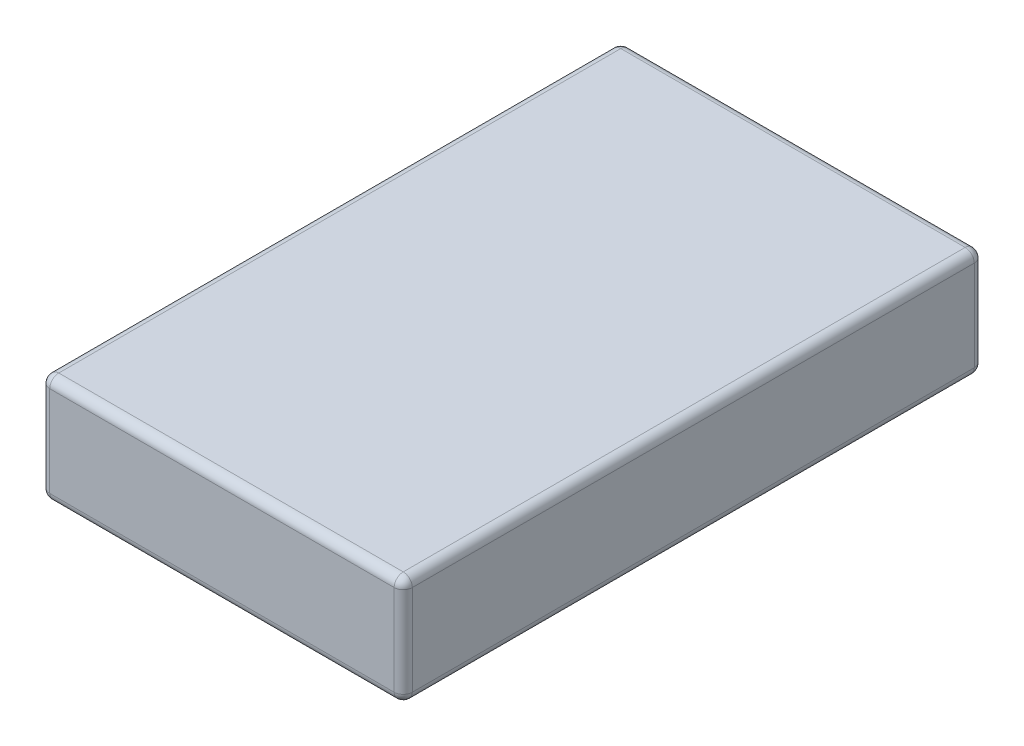
ISO-10303-21;
HEADER;
FILE_DESCRIPTION(('STEP AP214'),'2;1');
FILE_NAME('part.step','',(''),(''),'','','');
FILE_SCHEMA(('AUTOMOTIVE_DESIGN { 1 0 10303 214 1 1 1 1 }'));
ENDSEC;
DATA;
#1=APPLICATION_CONTEXT('core data for automotive mechanical design processes');
#2=APPLICATION_PROTOCOL_DEFINITION('international standard','automotive_design',2000,#1);
#3=PRODUCT_CONTEXT('',#1,'mechanical');
#4=PRODUCT('Part','Part','',(#3));
#5=PRODUCT_RELATED_PRODUCT_CATEGORY('part','',(#4));
#6=PRODUCT_DEFINITION_FORMATION('','',#4);
#7=PRODUCT_DEFINITION_CONTEXT('part definition',#1,'design');
#8=PRODUCT_DEFINITION('design','',#6,#7);
#9=PRODUCT_DEFINITION_SHAPE('','',#8);
#10=(LENGTH_UNIT() NAMED_UNIT(*) SI_UNIT(.MILLI.,.METRE.));
#11=(NAMED_UNIT(*) PLANE_ANGLE_UNIT() SI_UNIT($,.RADIAN.));
#12=(NAMED_UNIT(*) SI_UNIT($,.STERADIAN.) SOLID_ANGLE_UNIT());
#13=UNCERTAINTY_MEASURE_WITH_UNIT(LENGTH_MEASURE(1.E-05),#10,'distance_accuracy_value','');
#14=(GEOMETRIC_REPRESENTATION_CONTEXT(3) GLOBAL_UNCERTAINTY_ASSIGNED_CONTEXT((#13)) GLOBAL_UNIT_ASSIGNED_CONTEXT((#10,
#11,#12)) REPRESENTATION_CONTEXT('',''));
#15=CARTESIAN_POINT('',(0.,0.,0.));
#16=DIRECTION('',(0.,0.,1.));
#17=DIRECTION('',(1.,0.,0.));
#18=AXIS2_PLACEMENT_3D('',#15,#16,#17);
#19=CARTESIAN_POINT('',(10.,6.,16.));
#20=DIRECTION('',(-1.,0.,0.));
#21=DIRECTION('',(0.,0.,1.));
#22=AXIS2_PLACEMENT_3D('',#19,#20,#21);
#23=PLANE('',#22);
#24=DIRECTION('',(0.,-1.,0.));
#25=VECTOR('',#24,1.);
#26=CARTESIAN_POINT('',(10.,6.,15.5));
#27=LINE('',#26,#25);
#28=CARTESIAN_POINT('',(10.,5.5,15.5));
#29=VERTEX_POINT('',#28);
#30=CARTESIAN_POINT('',(10.,0.5,15.5));
#31=VERTEX_POINT('',#30);
#32=EDGE_CURVE('E208',#29,#31,#27,.T.);
#33=ORIENTED_EDGE('',*,*,#32,.T.);
#34=DIRECTION('',(0.,0.,-1.));
#35=VECTOR('',#34,1.);
#36=CARTESIAN_POINT('',(10.,0.5,-16.));
#37=LINE('',#36,#35);
#38=CARTESIAN_POINT('',(10.,0.5,-15.5));
#39=VERTEX_POINT('',#38);
#40=EDGE_CURVE('E212',#31,#39,#37,.T.);
#41=ORIENTED_EDGE('',*,*,#40,.T.);
#42=DIRECTION('',(0.,-1.,0.));
#43=VECTOR('',#42,1.);
#44=CARTESIAN_POINT('',(10.,6.,-15.5));
#45=LINE('',#44,#43);
#46=CARTESIAN_POINT('',(10.,5.5,-15.5));
#47=VERTEX_POINT('',#46);
#48=EDGE_CURVE('E205',#39,#47,#45,.F.);
#49=ORIENTED_EDGE('',*,*,#48,.T.);
#50=DIRECTION('',(0.,0.,-1.));
#51=VECTOR('',#50,1.);
#52=CARTESIAN_POINT('',(10.,5.5,16.));
#53=LINE('',#52,#51);
#54=EDGE_CURVE('E202',#47,#29,#53,.F.);
#55=ORIENTED_EDGE('',*,*,#54,.T.);
#56=EDGE_LOOP('',(#33,#41,#49,#55));
#57=FACE_BOUND('',#56,.T.);
#58=ADVANCED_FACE('F39',(#57),#23,.F.);
#59=CARTESIAN_POINT('',(-10.,6.,-16.));
#60=DIRECTION('',(0.,0.,1.));
#61=DIRECTION('',(1.,0.,0.));
#62=AXIS2_PLACEMENT_3D('',#59,#60,#61);
#63=PLANE('',#62);
#64=DIRECTION('',(0.,-1.,0.));
#65=VECTOR('',#64,1.);
#66=CARTESIAN_POINT('',(9.5,6.,-16.));
#67=LINE('',#66,#65);
#68=CARTESIAN_POINT('',(9.5,5.5,-16.));
#69=VERTEX_POINT('',#68);
#70=CARTESIAN_POINT('',(9.5,0.5,-16.));
#71=VERTEX_POINT('',#70);
#72=EDGE_CURVE('E181',#69,#71,#67,.T.);
#73=ORIENTED_EDGE('',*,*,#72,.T.);
#74=DIRECTION('',(-1.,0.,0.));
#75=VECTOR('',#74,1.);
#76=CARTESIAN_POINT('',(-10.,0.5,-16.));
#77=LINE('',#76,#75);
#78=CARTESIAN_POINT('',(-9.5,0.5,-16.));
#79=VERTEX_POINT('',#78);
#80=EDGE_CURVE('E188',#71,#79,#77,.T.);
#81=ORIENTED_EDGE('',*,*,#80,.T.);
#82=DIRECTION('',(0.,-1.,0.));
#83=VECTOR('',#82,1.);
#84=CARTESIAN_POINT('',(-9.5,6.,-16.));
#85=LINE('',#84,#83);
#86=CARTESIAN_POINT('',(-9.5,5.5,-16.));
#87=VERTEX_POINT('',#86);
#88=EDGE_CURVE('E184',#79,#87,#85,.F.);
#89=ORIENTED_EDGE('',*,*,#88,.T.);
#90=DIRECTION('',(-1.,0.,0.));
#91=VECTOR('',#90,1.);
#92=CARTESIAN_POINT('',(-10.,5.5,-16.));
#93=LINE('',#92,#91);
#94=EDGE_CURVE('E178',#87,#69,#93,.F.);
#95=ORIENTED_EDGE('',*,*,#94,.T.);
#96=EDGE_LOOP('',(#73,#81,#89,#95));
#97=FACE_BOUND('',#96,.T.);
#98=ADVANCED_FACE('F359',(#97),#63,.F.);
#99=CARTESIAN_POINT('',(-10.,6.,16.));
#100=DIRECTION('',(1.,0.,0.));
#101=DIRECTION('',(0.,0.,-1.));
#102=AXIS2_PLACEMENT_3D('',#99,#100,#101);
#103=PLANE('',#102);
#104=DIRECTION('',(0.,-1.,0.));
#105=VECTOR('',#104,1.);
#106=CARTESIAN_POINT('',(-10.,6.,-15.5));
#107=LINE('',#106,#105);
#108=CARTESIAN_POINT('',(-10.,5.5,-15.5));
#109=VERTEX_POINT('',#108);
#110=CARTESIAN_POINT('',(-10.,0.5,-15.5));
#111=VERTEX_POINT('',#110);
#112=EDGE_CURVE('E140',#109,#111,#107,.T.);
#113=ORIENTED_EDGE('',*,*,#112,.T.);
#114=DIRECTION('',(0.,0.,1.));
#115=VECTOR('',#114,1.);
#116=CARTESIAN_POINT('',(-10.,0.5,16.));
#117=LINE('',#116,#115);
#118=CARTESIAN_POINT('',(-10.,0.5,15.5));
#119=VERTEX_POINT('',#118);
#120=EDGE_CURVE('E135',#111,#119,#117,.T.);
#121=ORIENTED_EDGE('',*,*,#120,.T.);
#122=DIRECTION('',(0.,-1.,0.));
#123=VECTOR('',#122,1.);
#124=CARTESIAN_POINT('',(-10.,6.,15.5));
#125=LINE('',#124,#123);
#126=CARTESIAN_POINT('',(-10.,5.5,15.5));
#127=VERTEX_POINT('',#126);
#128=EDGE_CURVE('E127',#119,#127,#125,.F.);
#129=ORIENTED_EDGE('',*,*,#128,.T.);
#130=DIRECTION('',(0.,0.,1.));
#131=VECTOR('',#130,1.);
#132=CARTESIAN_POINT('',(-10.,5.5,16.));
#133=LINE('',#132,#131);
#134=EDGE_CURVE('E132',#127,#109,#133,.F.);
#135=ORIENTED_EDGE('',*,*,#134,.T.);
#136=EDGE_LOOP('',(#113,#121,#129,#135));
#137=FACE_BOUND('',#136,.T.);
#138=ADVANCED_FACE('F130',(#137),#103,.F.);
#139=CARTESIAN_POINT('',(-10.,6.,16.));
#140=DIRECTION('',(0.,0.,-1.));
#141=DIRECTION('',(-1.,0.,0.));
#142=AXIS2_PLACEMENT_3D('',#139,#140,#141);
#143=PLANE('',#142);
#144=DIRECTION('',(0.,-1.,0.));
#145=VECTOR('',#144,1.);
#146=CARTESIAN_POINT('',(-9.5,6.,16.));
#147=LINE('',#146,#145);
#148=CARTESIAN_POINT('',(-9.5,5.5,16.));
#149=VERTEX_POINT('',#148);
#150=CARTESIAN_POINT('',(-9.5,0.5,16.));
#151=VERTEX_POINT('',#150);
#152=EDGE_CURVE('E148',#149,#151,#147,.T.);
#153=ORIENTED_EDGE('',*,*,#152,.T.);
#154=DIRECTION('',(1.,0.,0.));
#155=VECTOR('',#154,1.);
#156=CARTESIAN_POINT('',(10.,0.5,16.));
#157=LINE('',#156,#155);
#158=CARTESIAN_POINT('',(9.5,0.5,16.));
#159=VERTEX_POINT('',#158);
#160=EDGE_CURVE('E199',#151,#159,#157,.T.);
#161=ORIENTED_EDGE('',*,*,#160,.T.);
#162=DIRECTION('',(0.,-1.,0.));
#163=VECTOR('',#162,1.);
#164=CARTESIAN_POINT('',(9.5,6.,16.));
#165=LINE('',#164,#163);
#166=CARTESIAN_POINT('',(9.5,5.5,16.));
#167=VERTEX_POINT('',#166);
#168=EDGE_CURVE('E194',#159,#167,#165,.F.);
#169=ORIENTED_EDGE('',*,*,#168,.T.);
#170=DIRECTION('',(1.,0.,0.));
#171=VECTOR('',#170,1.);
#172=CARTESIAN_POINT('',(-10.,5.5,16.));
#173=LINE('',#172,#171);
#174=EDGE_CURVE('E191',#167,#149,#173,.F.);
#175=ORIENTED_EDGE('',*,*,#174,.T.);
#176=EDGE_LOOP('',(#153,#161,#169,#175));
#177=FACE_BOUND('',#176,.T.);
#178=ADVANCED_FACE('F350',(#177),#143,.F.);
#179=CARTESIAN_POINT('',(0.,6.,0.));
#180=DIRECTION('',(0.,-1.,0.));
#181=DIRECTION('',(0.,0.,-1.));
#182=AXIS2_PLACEMENT_3D('',#179,#180,#181);
#183=PLANE('',#182);
#184=DIRECTION('',(0.,0.,1.));
#185=VECTOR('',#184,1.);
#186=CARTESIAN_POINT('',(-9.5,6.,0.));
#187=LINE('',#186,#185);
#188=CARTESIAN_POINT('',(-9.5,6.,-15.5));
#189=VERTEX_POINT('',#188);
#190=CARTESIAN_POINT('',(-9.5,6.,15.5));
#191=VERTEX_POINT('',#190);
#192=EDGE_CURVE('E49',#189,#191,#187,.T.);
#193=ORIENTED_EDGE('',*,*,#192,.T.);
#194=DIRECTION('',(1.,0.,0.));
#195=VECTOR('',#194,1.);
#196=CARTESIAN_POINT('',(0.,6.,15.5));
#197=LINE('',#196,#195);
#198=CARTESIAN_POINT('',(9.5,6.,15.5));
#199=VERTEX_POINT('',#198);
#200=EDGE_CURVE('E11',#191,#199,#197,.T.);
#201=ORIENTED_EDGE('',*,*,#200,.T.);
#202=DIRECTION('',(0.,0.,-1.));
#203=VECTOR('',#202,1.);
#204=CARTESIAN_POINT('',(9.5,6.,0.));
#205=LINE('',#204,#203);
#206=CARTESIAN_POINT('',(9.5,6.,-15.5));
#207=VERTEX_POINT('',#206);
#208=EDGE_CURVE('E228',#199,#207,#205,.T.);
#209=ORIENTED_EDGE('',*,*,#208,.T.);
#210=DIRECTION('',(-1.,0.,0.));
#211=VECTOR('',#210,1.);
#212=CARTESIAN_POINT('',(0.,6.,-15.5));
#213=LINE('',#212,#211);
#214=EDGE_CURVE('E60',#207,#189,#213,.T.);
#215=ORIENTED_EDGE('',*,*,#214,.T.);
#216=EDGE_LOOP('',(#193,#201,#209,#215));
#217=FACE_BOUND('',#216,.T.);
#218=ADVANCED_FACE('F352',(#217),#183,.F.);
#219=CARTESIAN_POINT('',(0.,0.,0.));
#220=DIRECTION('',(0.,-1.,0.));
#221=DIRECTION('',(0.,0.,-1.));
#222=AXIS2_PLACEMENT_3D('',#219,#220,#221);
#223=PLANE('',#222);
#224=DIRECTION('',(0.,0.,1.));
#225=VECTOR('',#224,1.);
#226=CARTESIAN_POINT('',(-9.5,0.,-16.));
#227=LINE('',#226,#225);
#228=CARTESIAN_POINT('',(-9.5,0.,15.5));
#229=VERTEX_POINT('',#228);
#230=CARTESIAN_POINT('',(-9.5,0.,-15.5));
#231=VERTEX_POINT('',#230);
#232=EDGE_CURVE('E221',#229,#231,#227,.F.);
#233=ORIENTED_EDGE('',*,*,#232,.T.);
#234=DIRECTION('',(-1.,0.,0.));
#235=VECTOR('',#234,1.);
#236=CARTESIAN_POINT('',(10.,0.,-15.5));
#237=LINE('',#236,#235);
#238=CARTESIAN_POINT('',(9.5,0.,-15.5));
#239=VERTEX_POINT('',#238);
#240=EDGE_CURVE('E224',#231,#239,#237,.F.);
#241=ORIENTED_EDGE('',*,*,#240,.T.);
#242=DIRECTION('',(0.,0.,-1.));
#243=VECTOR('',#242,1.);
#244=CARTESIAN_POINT('',(9.5,0.,16.));
#245=LINE('',#244,#243);
#246=CARTESIAN_POINT('',(9.5,0.,15.5));
#247=VERTEX_POINT('',#246);
#248=EDGE_CURVE('E215',#239,#247,#245,.F.);
#249=ORIENTED_EDGE('',*,*,#248,.T.);
#250=DIRECTION('',(1.,0.,0.));
#251=VECTOR('',#250,1.);
#252=CARTESIAN_POINT('',(-10.,0.,15.5));
#253=LINE('',#252,#251);
#254=EDGE_CURVE('E218',#247,#229,#253,.F.);
#255=ORIENTED_EDGE('',*,*,#254,.T.);
#256=EDGE_LOOP('',(#233,#241,#249,#255));
#257=FACE_BOUND('',#256,.T.);
#258=ADVANCED_FACE('F319',(#257),#223,.T.);
#259=CARTESIAN_POINT('',(9.5,6.,15.5));
#260=DIRECTION('',(0.,-1.,0.));
#261=DIRECTION('',(0.,0.,-1.));
#262=AXIS2_PLACEMENT_3D('',#259,#260,#261);
#263=CYLINDRICAL_SURFACE('',#262,0.5);
#264=CARTESIAN_POINT('',(9.5,5.5,15.5));
#265=DIRECTION('',(0.,1.,0.));
#266=DIRECTION('',(0.,0.,1.));
#267=AXIS2_PLACEMENT_3D('',#264,#265,#266);
#268=CIRCLE('',#267,0.5);
#269=EDGE_CURVE('E43',#167,#29,#268,.T.);
#270=ORIENTED_EDGE('',*,*,#269,.F.);
#271=ORIENTED_EDGE('',*,*,#168,.F.);
#272=CARTESIAN_POINT('',(9.5,0.5,15.5));
#273=DIRECTION('',(0.,-1.,0.));
#274=DIRECTION('',(0.,0.,-1.));
#275=AXIS2_PLACEMENT_3D('',#272,#273,#274);
#276=CIRCLE('',#275,0.5);
#277=EDGE_CURVE('E172',#31,#159,#276,.T.);
#278=ORIENTED_EDGE('',*,*,#277,.F.);
#279=ORIENTED_EDGE('',*,*,#32,.F.);
#280=EDGE_LOOP('',(#270,#271,#278,#279));
#281=FACE_BOUND('',#280,.T.);
#282=ADVANCED_FACE('F41',(#281),#263,.T.);
#283=CARTESIAN_POINT('',(9.5,5.5,15.5));
#284=DIRECTION('',(1.,0.,0.));
#285=DIRECTION('',(0.,0.,-1.));
#286=AXIS2_PLACEMENT_3D('',#283,#284,#285);
#287=SPHERICAL_SURFACE('',#286,0.5);
#288=CARTESIAN_POINT('',(9.5,5.5,15.5));
#289=DIRECTION('',(1.,0.,0.));
#290=DIRECTION('',(0.,0.,-1.));
#291=AXIS2_PLACEMENT_3D('',#288,#289,#290);
#292=CIRCLE('',#291,0.5);
#293=EDGE_CURVE('E295',#167,#199,#292,.F.);
#294=ORIENTED_EDGE('',*,*,#293,.F.);
#295=ORIENTED_EDGE('',*,*,#269,.T.);
#296=CARTESIAN_POINT('',(9.5,5.5,15.5));
#297=DIRECTION('',(0.,0.,1.));
#298=DIRECTION('',(1.,0.,0.));
#299=AXIS2_PLACEMENT_3D('',#296,#297,#298);
#300=CIRCLE('',#299,0.5);
#301=EDGE_CURVE('E299',#199,#29,#300,.F.);
#302=ORIENTED_EDGE('',*,*,#301,.F.);
#303=EDGE_LOOP('',(#294,#295,#302));
#304=FACE_BOUND('',#303,.T.);
#305=ADVANCED_FACE('F345',(#304),#287,.T.);
#306=CARTESIAN_POINT('',(9.5,0.5,15.5));
#307=DIRECTION('',(0.,0.,1.));
#308=DIRECTION('',(0.,-1.,0.));
#309=AXIS2_PLACEMENT_3D('',#306,#307,#308);
#310=SPHERICAL_SURFACE('',#309,0.5);
#311=CARTESIAN_POINT('',(9.5,0.5,15.5));
#312=DIRECTION('',(0.,0.,1.));
#313=DIRECTION('',(1.,0.,0.));
#314=AXIS2_PLACEMENT_3D('',#311,#312,#313);
#315=CIRCLE('',#314,0.5);
#316=EDGE_CURVE('E287',#31,#247,#315,.F.);
#317=ORIENTED_EDGE('',*,*,#316,.F.);
#318=ORIENTED_EDGE('',*,*,#277,.T.);
#319=CARTESIAN_POINT('',(9.5,0.5,15.5));
#320=DIRECTION('',(1.,0.,0.));
#321=DIRECTION('',(0.,0.,-1.));
#322=AXIS2_PLACEMENT_3D('',#319,#320,#321);
#323=CIRCLE('',#322,0.5);
#324=EDGE_CURVE('E291',#247,#159,#323,.F.);
#325=ORIENTED_EDGE('',*,*,#324,.F.);
#326=EDGE_LOOP('',(#317,#318,#325));
#327=FACE_BOUND('',#326,.T.);
#328=ADVANCED_FACE('F308',(#327),#310,.T.);
#329=CARTESIAN_POINT('',(9.5,5.5,0.));
#330=DIRECTION('',(0.,0.,-1.));
#331=DIRECTION('',(-1.,0.,0.));
#332=AXIS2_PLACEMENT_3D('',#329,#330,#331);
#333=CYLINDRICAL_SURFACE('',#332,0.5);
#334=ORIENTED_EDGE('',*,*,#301,.T.);
#335=ORIENTED_EDGE('',*,*,#54,.F.);
#336=CARTESIAN_POINT('',(9.5,5.5,-15.5));
#337=DIRECTION('',(0.,0.,-1.));
#338=DIRECTION('',(-1.,0.,0.));
#339=AXIS2_PLACEMENT_3D('',#336,#337,#338);
#340=CIRCLE('',#339,0.5);
#341=EDGE_CURVE('E279',#207,#47,#340,.T.);
#342=ORIENTED_EDGE('',*,*,#341,.F.);
#343=ORIENTED_EDGE('',*,*,#208,.F.);
#344=EDGE_LOOP('',(#334,#335,#342,#343));
#345=FACE_BOUND('',#344,.T.);
#346=ADVANCED_FACE('F340',(#345),#333,.T.);
#347=CARTESIAN_POINT('',(0.,5.5,15.5));
#348=DIRECTION('',(1.,0.,0.));
#349=DIRECTION('',(0.,0.,-1.));
#350=AXIS2_PLACEMENT_3D('',#347,#348,#349);
#351=CYLINDRICAL_SURFACE('',#350,0.5);
#352=ORIENTED_EDGE('',*,*,#293,.T.);
#353=ORIENTED_EDGE('',*,*,#200,.F.);
#354=CARTESIAN_POINT('',(-9.5,5.5,15.5));
#355=DIRECTION('',(-1.,0.,0.));
#356=DIRECTION('',(0.,0.,1.));
#357=AXIS2_PLACEMENT_3D('',#354,#355,#356);
#358=CIRCLE('',#357,0.5);
#359=EDGE_CURVE('E153',#149,#191,#358,.T.);
#360=ORIENTED_EDGE('',*,*,#359,.F.);
#361=ORIENTED_EDGE('',*,*,#174,.F.);
#362=EDGE_LOOP('',(#352,#353,#360,#361));
#363=FACE_BOUND('',#362,.T.);
#364=ADVANCED_FACE('F348',(#363),#351,.T.);
#365=CARTESIAN_POINT('',(-9.5,6.,15.5));
#366=DIRECTION('',(0.,-1.,0.));
#367=DIRECTION('',(0.,0.,-1.));
#368=AXIS2_PLACEMENT_3D('',#365,#366,#367);
#369=CYLINDRICAL_SURFACE('',#368,0.5);
#370=CARTESIAN_POINT('',(-9.5,0.5,15.5));
#371=DIRECTION('',(0.,-1.,0.));
#372=DIRECTION('',(0.,0.,-1.));
#373=AXIS2_PLACEMENT_3D('',#370,#371,#372);
#374=CIRCLE('',#373,0.5);
#375=EDGE_CURVE('E154',#151,#119,#374,.T.);
#376=ORIENTED_EDGE('',*,*,#375,.F.);
#377=ORIENTED_EDGE('',*,*,#152,.F.);
#378=CARTESIAN_POINT('',(-9.5,5.5,15.5));
#379=DIRECTION('',(0.,1.,0.));
#380=DIRECTION('',(0.,0.,1.));
#381=AXIS2_PLACEMENT_3D('',#378,#379,#380);
#382=CIRCLE('',#381,0.5);
#383=EDGE_CURVE('E144',#127,#149,#382,.T.);
#384=ORIENTED_EDGE('',*,*,#383,.F.);
#385=ORIENTED_EDGE('',*,*,#128,.F.);
#386=EDGE_LOOP('',(#376,#377,#384,#385));
#387=FACE_BOUND('',#386,.T.);
#388=ADVANCED_FACE('F146',(#387),#369,.T.);
#389=CARTESIAN_POINT('',(-10.,0.5,15.5));
#390=DIRECTION('',(-1.,0.,0.));
#391=DIRECTION('',(0.,0.,1.));
#392=AXIS2_PLACEMENT_3D('',#389,#390,#391);
#393=CYLINDRICAL_SURFACE('',#392,0.5);
#394=ORIENTED_EDGE('',*,*,#324,.T.);
#395=ORIENTED_EDGE('',*,*,#160,.F.);
#396=CARTESIAN_POINT('',(-9.5,0.5,15.5));
#397=DIRECTION('',(-1.,0.,0.));
#398=DIRECTION('',(0.,0.,1.));
#399=AXIS2_PLACEMENT_3D('',#396,#397,#398);
#400=CIRCLE('',#399,0.5);
#401=EDGE_CURVE('E272',#229,#151,#400,.T.);
#402=ORIENTED_EDGE('',*,*,#401,.F.);
#403=ORIENTED_EDGE('',*,*,#254,.F.);
#404=EDGE_LOOP('',(#394,#395,#402,#403));
#405=FACE_BOUND('',#404,.T.);
#406=ADVANCED_FACE('F315',(#405),#393,.T.);
#407=CARTESIAN_POINT('',(9.5,0.5,16.));
#408=DIRECTION('',(0.,0.,1.));
#409=DIRECTION('',(1.,0.,0.));
#410=AXIS2_PLACEMENT_3D('',#407,#408,#409);
#411=CYLINDRICAL_SURFACE('',#410,0.5);
#412=ORIENTED_EDGE('',*,*,#316,.T.);
#413=ORIENTED_EDGE('',*,*,#248,.F.);
#414=CARTESIAN_POINT('',(9.5,0.5,-15.5));
#415=DIRECTION('',(0.,0.,-1.));
#416=DIRECTION('',(-1.,0.,0.));
#417=AXIS2_PLACEMENT_3D('',#414,#415,#416);
#418=CIRCLE('',#417,0.5);
#419=EDGE_CURVE('E268',#39,#239,#418,.T.);
#420=ORIENTED_EDGE('',*,*,#419,.F.);
#421=ORIENTED_EDGE('',*,*,#40,.F.);
#422=EDGE_LOOP('',(#412,#413,#420,#421));
#423=FACE_BOUND('',#422,.T.);
#424=ADVANCED_FACE('F325',(#423),#411,.T.);
#425=CARTESIAN_POINT('',(9.5,6.,-15.5));
#426=DIRECTION('',(0.,-1.,0.));
#427=DIRECTION('',(0.,0.,-1.));
#428=AXIS2_PLACEMENT_3D('',#425,#426,#427);
#429=CYLINDRICAL_SURFACE('',#428,0.5);
#430=CARTESIAN_POINT('',(9.5,5.5,-15.5));
#431=DIRECTION('',(0.,1.,0.));
#432=DIRECTION('',(0.,0.,1.));
#433=AXIS2_PLACEMENT_3D('',#430,#431,#432);
#434=CIRCLE('',#433,0.5);
#435=EDGE_CURVE('E283',#47,#69,#434,.T.);
#436=ORIENTED_EDGE('',*,*,#435,.F.);
#437=ORIENTED_EDGE('',*,*,#48,.F.);
#438=CARTESIAN_POINT('',(9.5,0.5,-15.5));
#439=DIRECTION('',(0.,-1.,0.));
#440=DIRECTION('',(0.,0.,-1.));
#441=AXIS2_PLACEMENT_3D('',#438,#439,#440);
#442=CIRCLE('',#441,0.5);
#443=EDGE_CURVE('E264',#71,#39,#442,.T.);
#444=ORIENTED_EDGE('',*,*,#443,.F.);
#445=ORIENTED_EDGE('',*,*,#72,.F.);
#446=EDGE_LOOP('',(#436,#437,#444,#445));
#447=FACE_BOUND('',#446,.T.);
#448=ADVANCED_FACE('F332',(#447),#429,.T.);
#449=CARTESIAN_POINT('',(9.5,5.5,-15.5));
#450=DIRECTION('',(1.,0.,0.));
#451=DIRECTION('',(0.,0.,-1.));
#452=AXIS2_PLACEMENT_3D('',#449,#450,#451);
#453=SPHERICAL_SURFACE('',#452,0.5);
#454=ORIENTED_EDGE('',*,*,#341,.T.);
#455=ORIENTED_EDGE('',*,*,#435,.T.);
#456=CARTESIAN_POINT('',(9.5,5.5,-15.5));
#457=DIRECTION('',(1.,0.,0.));
#458=DIRECTION('',(0.,0.,-1.));
#459=AXIS2_PLACEMENT_3D('',#456,#457,#458);
#460=CIRCLE('',#459,0.5);
#461=EDGE_CURVE('E161',#207,#69,#460,.F.);
#462=ORIENTED_EDGE('',*,*,#461,.F.);
#463=EDGE_LOOP('',(#454,#455,#462));
#464=FACE_BOUND('',#463,.T.);
#465=ADVANCED_FACE('F338',(#464),#453,.T.);
#466=CARTESIAN_POINT('',(-9.5,5.5,15.5));
#467=DIRECTION('',(0.,0.,1.));
#468=DIRECTION('',(1.,0.,0.));
#469=AXIS2_PLACEMENT_3D('',#466,#467,#468);
#470=SPHERICAL_SURFACE('',#469,0.5);
#471=ORIENTED_EDGE('',*,*,#383,.T.);
#472=ORIENTED_EDGE('',*,*,#359,.T.);
#473=CARTESIAN_POINT('',(-9.5,5.5,15.5));
#474=DIRECTION('',(0.,0.,1.));
#475=DIRECTION('',(1.,0.,0.));
#476=AXIS2_PLACEMENT_3D('',#473,#474,#475);
#477=CIRCLE('',#476,0.5);
#478=EDGE_CURVE('E157',#127,#191,#477,.F.);
#479=ORIENTED_EDGE('',*,*,#478,.F.);
#480=EDGE_LOOP('',(#471,#472,#479));
#481=FACE_BOUND('',#480,.T.);
#482=ADVANCED_FACE('F158',(#481),#470,.T.);
#483=CARTESIAN_POINT('',(-9.5,0.5,15.5));
#484=DIRECTION('',(0.,0.,1.));
#485=DIRECTION('',(0.,-1.,0.));
#486=AXIS2_PLACEMENT_3D('',#483,#484,#485);
#487=SPHERICAL_SURFACE('',#486,0.5);
#488=ORIENTED_EDGE('',*,*,#401,.T.);
#489=ORIENTED_EDGE('',*,*,#375,.T.);
#490=CARTESIAN_POINT('',(-9.5,0.5,15.5));
#491=DIRECTION('',(0.,0.,1.));
#492=DIRECTION('',(1.,0.,0.));
#493=AXIS2_PLACEMENT_3D('',#490,#491,#492);
#494=CIRCLE('',#493,0.5);
#495=EDGE_CURVE('E162',#229,#119,#494,.F.);
#496=ORIENTED_EDGE('',*,*,#495,.F.);
#497=EDGE_LOOP('',(#488,#489,#496));
#498=FACE_BOUND('',#497,.T.);
#499=ADVANCED_FACE('F399',(#498),#487,.T.);
#500=CARTESIAN_POINT('',(9.5,0.5,-15.5));
#501=DIRECTION('',(1.,0.,0.));
#502=DIRECTION('',(0.,1.,0.));
#503=AXIS2_PLACEMENT_3D('',#500,#501,#502);
#504=SPHERICAL_SURFACE('',#503,0.5);
#505=ORIENTED_EDGE('',*,*,#443,.T.);
#506=ORIENTED_EDGE('',*,*,#419,.T.);
#507=CARTESIAN_POINT('',(9.5,0.5,-15.5));
#508=DIRECTION('',(1.,0.,0.));
#509=DIRECTION('',(0.,0.,-1.));
#510=AXIS2_PLACEMENT_3D('',#507,#508,#509);
#511=CIRCLE('',#510,0.5);
#512=EDGE_CURVE('E255',#71,#239,#511,.F.);
#513=ORIENTED_EDGE('',*,*,#512,.F.);
#514=EDGE_LOOP('',(#505,#506,#513));
#515=FACE_BOUND('',#514,.T.);
#516=ADVANCED_FACE('F395',(#515),#504,.T.);
#517=CARTESIAN_POINT('',(0.,5.5,-15.5));
#518=DIRECTION('',(-1.,0.,0.));
#519=DIRECTION('',(0.,0.,1.));
#520=AXIS2_PLACEMENT_3D('',#517,#518,#519);
#521=CYLINDRICAL_SURFACE('',#520,0.5);
#522=ORIENTED_EDGE('',*,*,#461,.T.);
#523=ORIENTED_EDGE('',*,*,#94,.F.);
#524=CARTESIAN_POINT('',(-9.5,5.5,-15.5));
#525=DIRECTION('',(-1.,0.,0.));
#526=DIRECTION('',(0.,0.,1.));
#527=AXIS2_PLACEMENT_3D('',#524,#525,#526);
#528=CIRCLE('',#527,0.5);
#529=EDGE_CURVE('E251',#189,#87,#528,.T.);
#530=ORIENTED_EDGE('',*,*,#529,.F.);
#531=ORIENTED_EDGE('',*,*,#214,.F.);
#532=EDGE_LOOP('',(#522,#523,#530,#531));
#533=FACE_BOUND('',#532,.T.);
#534=ADVANCED_FACE('F392',(#533),#521,.T.);
#535=CARTESIAN_POINT('',(-9.5,5.5,0.));
#536=DIRECTION('',(0.,0.,1.));
#537=DIRECTION('',(1.,0.,0.));
#538=AXIS2_PLACEMENT_3D('',#535,#536,#537);
#539=CYLINDRICAL_SURFACE('',#538,0.5);
#540=ORIENTED_EDGE('',*,*,#478,.T.);
#541=ORIENTED_EDGE('',*,*,#192,.F.);
#542=CARTESIAN_POINT('',(-9.5,5.5,-15.5));
#543=DIRECTION('',(0.,0.,-1.));
#544=DIRECTION('',(-1.,0.,0.));
#545=AXIS2_PLACEMENT_3D('',#542,#543,#544);
#546=CIRCLE('',#545,0.5);
#547=EDGE_CURVE('E166',#109,#189,#546,.T.);
#548=ORIENTED_EDGE('',*,*,#547,.F.);
#549=ORIENTED_EDGE('',*,*,#134,.F.);
#550=EDGE_LOOP('',(#540,#541,#548,#549));
#551=FACE_BOUND('',#550,.T.);
#552=ADVANCED_FACE('F164',(#551),#539,.T.);
#553=CARTESIAN_POINT('',(-9.5,0.5,16.));
#554=DIRECTION('',(0.,0.,-1.));
#555=DIRECTION('',(-1.,0.,0.));
#556=AXIS2_PLACEMENT_3D('',#553,#554,#555);
#557=CYLINDRICAL_SURFACE('',#556,0.5);
#558=ORIENTED_EDGE('',*,*,#495,.T.);
#559=ORIENTED_EDGE('',*,*,#120,.F.);
#560=CARTESIAN_POINT('',(-9.5,0.5,-15.5));
#561=DIRECTION('',(0.,0.,-1.));
#562=DIRECTION('',(-1.,0.,0.));
#563=AXIS2_PLACEMENT_3D('',#560,#561,#562);
#564=CIRCLE('',#563,0.5);
#565=EDGE_CURVE('E245',#231,#111,#564,.T.);
#566=ORIENTED_EDGE('',*,*,#565,.F.);
#567=ORIENTED_EDGE('',*,*,#232,.F.);
#568=EDGE_LOOP('',(#558,#559,#566,#567));
#569=FACE_BOUND('',#568,.T.);
#570=ADVANCED_FACE('F385',(#569),#557,.T.);
#571=CARTESIAN_POINT('',(-10.,0.5,-15.5));
#572=DIRECTION('',(1.,0.,0.));
#573=DIRECTION('',(0.,0.,-1.));
#574=AXIS2_PLACEMENT_3D('',#571,#572,#573);
#575=CYLINDRICAL_SURFACE('',#574,0.5);
#576=ORIENTED_EDGE('',*,*,#512,.T.);
#577=ORIENTED_EDGE('',*,*,#240,.F.);
#578=CARTESIAN_POINT('',(-9.5,0.5,-15.5));
#579=DIRECTION('',(-1.,0.,0.));
#580=DIRECTION('',(0.,0.,1.));
#581=AXIS2_PLACEMENT_3D('',#578,#579,#580);
#582=CIRCLE('',#581,0.5);
#583=EDGE_CURVE('E241',#79,#231,#582,.T.);
#584=ORIENTED_EDGE('',*,*,#583,.F.);
#585=ORIENTED_EDGE('',*,*,#80,.F.);
#586=EDGE_LOOP('',(#576,#577,#584,#585));
#587=FACE_BOUND('',#586,.T.);
#588=ADVANCED_FACE('F381',(#587),#575,.T.);
#589=CARTESIAN_POINT('',(-9.5,5.5,-15.5));
#590=DIRECTION('',(0.,1.,0.));
#591=DIRECTION('',(0.,0.,1.));
#592=AXIS2_PLACEMENT_3D('',#589,#590,#591);
#593=SPHERICAL_SURFACE('',#592,0.5);
#594=ORIENTED_EDGE('',*,*,#547,.T.);
#595=ORIENTED_EDGE('',*,*,#529,.T.);
#596=CARTESIAN_POINT('',(-9.5,5.5,-15.5));
#597=DIRECTION('',(0.,1.,0.));
#598=DIRECTION('',(0.,0.,1.));
#599=AXIS2_PLACEMENT_3D('',#596,#597,#598);
#600=CIRCLE('',#599,0.5);
#601=EDGE_CURVE('E238',#109,#87,#600,.F.);
#602=ORIENTED_EDGE('',*,*,#601,.F.);
#603=EDGE_LOOP('',(#594,#595,#602));
#604=FACE_BOUND('',#603,.T.);
#605=ADVANCED_FACE('F377',(#604),#593,.T.);
#606=CARTESIAN_POINT('',(-9.5,0.5,-15.5));
#607=DIRECTION('',(0.,-1.,0.));
#608=DIRECTION('',(0.,0.,-1.));
#609=AXIS2_PLACEMENT_3D('',#606,#607,#608);
#610=SPHERICAL_SURFACE('',#609,0.5);
#611=ORIENTED_EDGE('',*,*,#583,.T.);
#612=ORIENTED_EDGE('',*,*,#565,.T.);
#613=CARTESIAN_POINT('',(-9.5,0.5,-15.5));
#614=DIRECTION('',(0.,-1.,0.));
#615=DIRECTION('',(0.,0.,-1.));
#616=AXIS2_PLACEMENT_3D('',#613,#614,#615);
#617=CIRCLE('',#616,0.5);
#618=EDGE_CURVE('E235',#79,#111,#617,.F.);
#619=ORIENTED_EDGE('',*,*,#618,.F.);
#620=EDGE_LOOP('',(#611,#612,#619));
#621=FACE_BOUND('',#620,.T.);
#622=ADVANCED_FACE('F373',(#621),#610,.T.);
#623=CARTESIAN_POINT('',(-9.5,6.,-15.5));
#624=DIRECTION('',(0.,-1.,0.));
#625=DIRECTION('',(0.,0.,-1.));
#626=AXIS2_PLACEMENT_3D('',#623,#624,#625);
#627=CYLINDRICAL_SURFACE('',#626,0.5);
#628=ORIENTED_EDGE('',*,*,#601,.T.);
#629=ORIENTED_EDGE('',*,*,#88,.F.);
#630=ORIENTED_EDGE('',*,*,#618,.T.);
#631=ORIENTED_EDGE('',*,*,#112,.F.);
#632=EDGE_LOOP('',(#628,#629,#630,#631));
#633=FACE_BOUND('',#632,.T.);
#634=ADVANCED_FACE('F370',(#633),#627,.T.);
#635=CLOSED_SHELL('',(#58,#98,#138,#178,#218,#258,#282,#305,#328,#346,#364,#388,#406,#424,#448,
#465,#482,#499,#516,#534,#552,#570,#588,#605,#622,#634));
#636=MANIFOLD_SOLID_BREP('B2',#635);
#637=ADVANCED_BREP_SHAPE_REPRESENTATION('',(#18,#636),#14);
#638=SHAPE_DEFINITION_REPRESENTATION(#9,#637);
ENDSEC;
END-ISO-10303-21;
